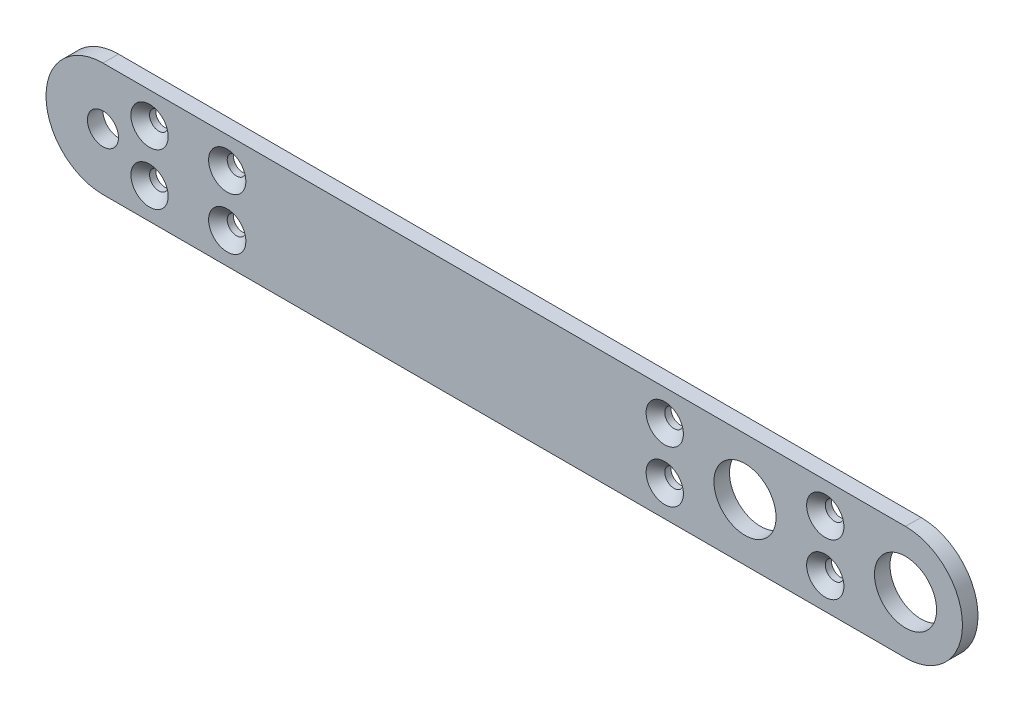
ISO-10303-21;
HEADER;
FILE_DESCRIPTION(('STEP AP214'),'2;1');
FILE_NAME('part.step','',(''),(''),'','','');
FILE_SCHEMA(('AUTOMOTIVE_DESIGN { 1 0 10303 214 1 1 1 1 }'));
ENDSEC;
DATA;
#1=APPLICATION_CONTEXT('core data for automotive mechanical design processes');
#2=APPLICATION_PROTOCOL_DEFINITION('international standard','automotive_design',2000,#1);
#3=PRODUCT_CONTEXT('',#1,'mechanical');
#4=PRODUCT('Part','Part','',(#3));
#5=PRODUCT_RELATED_PRODUCT_CATEGORY('part','',(#4));
#6=PRODUCT_DEFINITION_FORMATION('','',#4);
#7=PRODUCT_DEFINITION_CONTEXT('part definition',#1,'design');
#8=PRODUCT_DEFINITION('design','',#6,#7);
#9=PRODUCT_DEFINITION_SHAPE('','',#8);
#10=(LENGTH_UNIT() NAMED_UNIT(*) SI_UNIT(.MILLI.,.METRE.));
#11=(NAMED_UNIT(*) PLANE_ANGLE_UNIT() SI_UNIT($,.RADIAN.));
#12=(NAMED_UNIT(*) SI_UNIT($,.STERADIAN.) SOLID_ANGLE_UNIT());
#13=UNCERTAINTY_MEASURE_WITH_UNIT(LENGTH_MEASURE(1.E-05),#10,'distance_accuracy_value','');
#14=(GEOMETRIC_REPRESENTATION_CONTEXT(3) GLOBAL_UNCERTAINTY_ASSIGNED_CONTEXT((#13)) GLOBAL_UNIT_ASSIGNED_CONTEXT((#10,
#11,#12)) REPRESENTATION_CONTEXT('',''));
#15=CARTESIAN_POINT('',(0.,0.,0.));
#16=DIRECTION('',(0.,0.,1.));
#17=DIRECTION('',(1.,0.,0.));
#18=AXIS2_PLACEMENT_3D('',#15,#16,#17);
#19=CARTESIAN_POINT('',(15.5,0.,1.5));
#20=DIRECTION('',(0.,0.,1.));
#21=DIRECTION('',(1.,0.,0.));
#22=AXIS2_PLACEMENT_3D('',#19,#20,#21);
#23=PLANE('',#22);
#24=CARTESIAN_POINT('',(7.75,-2.49999999999999,1.5));
#25=DIRECTION('',(0.,0.,1.));
#26=DIRECTION('',(1.,0.,0.));
#27=AXIS2_PLACEMENT_3D('',#24,#25,#26);
#28=CIRCLE('',#27,1.8);
#29=CARTESIAN_POINT('',(9.55,-2.49999999999999,1.5));
#30=VERTEX_POINT('',#29);
#31=EDGE_CURVE('E197',#30,#30,#28,.T.);
#32=ORIENTED_EDGE('',*,*,#31,.F.);
#33=EDGE_LOOP('',(#32));
#34=FACE_BOUND('',#33,.T.);
#35=CARTESIAN_POINT('',(-7.75,-2.49999999999999,1.5));
#36=DIRECTION('',(0.,0.,1.));
#37=DIRECTION('',(1.,0.,0.));
#38=AXIS2_PLACEMENT_3D('',#35,#36,#37);
#39=CIRCLE('',#38,1.8);
#40=CARTESIAN_POINT('',(-5.95,-2.49999999999999,1.5));
#41=VERTEX_POINT('',#40);
#42=EDGE_CURVE('E188',#41,#41,#39,.T.);
#43=ORIENTED_EDGE('',*,*,#42,.F.);
#44=EDGE_LOOP('',(#43));
#45=FACE_BOUND('',#44,.T.);
#46=CARTESIAN_POINT('',(-57.5,-2.49999999999999,1.5));
#47=DIRECTION('',(0.,0.,1.));
#48=DIRECTION('',(1.,0.,0.));
#49=AXIS2_PLACEMENT_3D('',#46,#47,#48);
#50=CIRCLE('',#49,1.8);
#51=CARTESIAN_POINT('',(-55.7,-2.49999999999999,1.5));
#52=VERTEX_POINT('',#51);
#53=EDGE_CURVE('E179',#52,#52,#50,.T.);
#54=ORIENTED_EDGE('',*,*,#53,.F.);
#55=EDGE_LOOP('',(#54));
#56=FACE_BOUND('',#55,.T.);
#57=CARTESIAN_POINT('',(-50.,-2.49999999999999,1.5));
#58=DIRECTION('',(0.,0.,1.));
#59=DIRECTION('',(1.,0.,0.));
#60=AXIS2_PLACEMENT_3D('',#57,#58,#59);
#61=CIRCLE('',#60,1.8);
#62=CARTESIAN_POINT('',(-48.2,-2.49999999999999,1.5));
#63=VERTEX_POINT('',#62);
#64=EDGE_CURVE('E170',#63,#63,#61,.T.);
#65=ORIENTED_EDGE('',*,*,#64,.F.);
#66=EDGE_LOOP('',(#65));
#67=FACE_BOUND('',#66,.T.);
#68=CARTESIAN_POINT('',(7.75,2.49999999999999,1.5));
#69=DIRECTION('',(0.,0.,1.));
#70=DIRECTION('',(1.,0.,0.));
#71=AXIS2_PLACEMENT_3D('',#68,#69,#70);
#72=CIRCLE('',#71,1.8);
#73=CARTESIAN_POINT('',(9.55,2.49999999999999,1.5));
#74=VERTEX_POINT('',#73);
#75=EDGE_CURVE('E161',#74,#74,#72,.T.);
#76=ORIENTED_EDGE('',*,*,#75,.F.);
#77=EDGE_LOOP('',(#76));
#78=FACE_BOUND('',#77,.T.);
#79=CARTESIAN_POINT('',(-7.75,2.49999999999999,1.5));
#80=DIRECTION('',(0.,0.,1.));
#81=DIRECTION('',(1.,0.,0.));
#82=AXIS2_PLACEMENT_3D('',#79,#80,#81);
#83=CIRCLE('',#82,1.8);
#84=CARTESIAN_POINT('',(-5.95,2.49999999999999,1.5));
#85=VERTEX_POINT('',#84);
#86=EDGE_CURVE('E152',#85,#85,#83,.T.);
#87=ORIENTED_EDGE('',*,*,#86,.F.);
#88=EDGE_LOOP('',(#87));
#89=FACE_BOUND('',#88,.T.);
#90=CARTESIAN_POINT('',(-57.5,2.49999999999999,1.5));
#91=DIRECTION('',(0.,0.,1.));
#92=DIRECTION('',(1.,0.,0.));
#93=AXIS2_PLACEMENT_3D('',#90,#91,#92);
#94=CIRCLE('',#93,1.8);
#95=CARTESIAN_POINT('',(-55.7,2.49999999999999,1.5));
#96=VERTEX_POINT('',#95);
#97=EDGE_CURVE('E143',#96,#96,#94,.T.);
#98=ORIENTED_EDGE('',*,*,#97,.F.);
#99=EDGE_LOOP('',(#98));
#100=FACE_BOUND('',#99,.T.);
#101=CARTESIAN_POINT('',(-50.,2.49999999999999,1.5));
#102=DIRECTION('',(0.,0.,1.));
#103=DIRECTION('',(1.,0.,0.));
#104=AXIS2_PLACEMENT_3D('',#101,#102,#103);
#105=CIRCLE('',#104,1.8);
#106=CARTESIAN_POINT('',(-48.2,2.49999999999999,1.5));
#107=VERTEX_POINT('',#106);
#108=EDGE_CURVE('E134',#107,#107,#105,.T.);
#109=ORIENTED_EDGE('',*,*,#108,.F.);
#110=EDGE_LOOP('',(#109));
#111=FACE_BOUND('',#110,.T.);
#112=CARTESIAN_POINT('',(0.,0.,1.5));
#113=DIRECTION('',(0.,0.,1.));
#114=DIRECTION('',(1.,0.,0.));
#115=AXIS2_PLACEMENT_3D('',#112,#113,#114);
#116=CIRCLE('',#115,3.);
#117=CARTESIAN_POINT('',(3.,0.,1.5));
#118=VERTEX_POINT('',#117);
#119=EDGE_CURVE('E114',#118,#118,#116,.T.);
#120=ORIENTED_EDGE('',*,*,#119,.F.);
#121=EDGE_LOOP('',(#120));
#122=FACE_BOUND('',#121,.T.);
#123=CARTESIAN_POINT('',(15.5,0.,1.5));
#124=DIRECTION('',(0.,0.,1.));
#125=DIRECTION('',(1.,0.,0.));
#126=AXIS2_PLACEMENT_3D('',#123,#124,#125);
#127=CIRCLE('',#126,5.5);
#128=CARTESIAN_POINT('',(15.5,-5.5,1.5));
#129=VERTEX_POINT('',#128);
#130=CARTESIAN_POINT('',(15.5,5.5,1.5));
#131=VERTEX_POINT('',#130);
#132=EDGE_CURVE('E84',#129,#131,#127,.T.);
#133=ORIENTED_EDGE('',*,*,#132,.T.);
#134=DIRECTION('',(-1.,0.,0.));
#135=VECTOR('',#134,1.);
#136=CARTESIAN_POINT('',(15.5,5.5,1.5));
#137=LINE('',#136,#135);
#138=CARTESIAN_POINT('',(-62.,5.49999999999999,1.5));
#139=VERTEX_POINT('',#138);
#140=EDGE_CURVE('E79',#131,#139,#137,.T.);
#141=ORIENTED_EDGE('',*,*,#140,.T.);
#142=CARTESIAN_POINT('',(-62.,-4.25440932483312E-13,1.5));
#143=DIRECTION('',(0.,0.,1.));
#144=DIRECTION('',(1.,0.,0.));
#145=AXIS2_PLACEMENT_3D('',#142,#143,#144);
#146=CIRCLE('',#145,5.49999999999999);
#147=CARTESIAN_POINT('',(-62.,-5.50000000000041,1.5));
#148=VERTEX_POINT('',#147);
#149=EDGE_CURVE('E82',#139,#148,#146,.T.);
#150=ORIENTED_EDGE('',*,*,#149,.T.);
#151=DIRECTION('',(1.,0.,0.));
#152=VECTOR('',#151,1.);
#153=CARTESIAN_POINT('',(-62.,-5.49999999999999,1.5));
#154=LINE('',#153,#152);
#155=EDGE_CURVE('E49',#148,#129,#154,.T.);
#156=ORIENTED_EDGE('',*,*,#155,.T.);
#157=EDGE_LOOP('',(#133,#141,#150,#156));
#158=FACE_BOUND('',#157,.T.);
#159=CARTESIAN_POINT('',(-62.,-4.25440932483312E-13,1.5));
#160=DIRECTION('',(0.,0.,1.));
#161=DIRECTION('',(1.,0.,0.));
#162=AXIS2_PLACEMENT_3D('',#159,#160,#161);
#163=CIRCLE('',#162,1.5);
#164=CARTESIAN_POINT('',(-60.5,-4.25440932483312E-13,1.5));
#165=VERTEX_POINT('',#164);
#166=EDGE_CURVE('E99',#165,#165,#163,.T.);
#167=ORIENTED_EDGE('',*,*,#166,.F.);
#168=EDGE_LOOP('',(#167));
#169=FACE_BOUND('',#168,.T.);
#170=CARTESIAN_POINT('',(15.5,0.,1.5));
#171=DIRECTION('',(0.,0.,1.));
#172=DIRECTION('',(1.,0.,0.));
#173=AXIS2_PLACEMENT_3D('',#170,#171,#172);
#174=CIRCLE('',#173,3.);
#175=CARTESIAN_POINT('',(18.5,0.,1.5));
#176=VERTEX_POINT('',#175);
#177=EDGE_CURVE('E120',#176,#176,#174,.T.);
#178=ORIENTED_EDGE('',*,*,#177,.F.);
#179=EDGE_LOOP('',(#178));
#180=FACE_BOUND('',#179,.T.);
#181=ADVANCED_FACE('F32',(#34,#45,#56,#67,#78,#89,#100,#111,#122,#158,#169,#180),#23,.T.);
#182=CARTESIAN_POINT('',(15.5,0.,0.));
#183=DIRECTION('',(0.,0.,1.));
#184=DIRECTION('',(1.,0.,0.));
#185=AXIS2_PLACEMENT_3D('',#182,#183,#184);
#186=PLANE('',#185);
#187=CARTESIAN_POINT('',(7.75,-2.49999999999999,0.));
#188=DIRECTION('',(0.,0.,1.));
#189=DIRECTION('',(1.,0.,0.));
#190=AXIS2_PLACEMENT_3D('',#187,#188,#189);
#191=CIRCLE('',#190,0.9);
#192=CARTESIAN_POINT('',(8.65,-2.49999999999999,0.));
#193=VERTEX_POINT('',#192);
#194=EDGE_CURVE('E191',#193,#193,#191,.T.);
#195=ORIENTED_EDGE('',*,*,#194,.T.);
#196=EDGE_LOOP('',(#195));
#197=FACE_BOUND('',#196,.T.);
#198=CARTESIAN_POINT('',(-7.75,-2.49999999999999,0.));
#199=DIRECTION('',(0.,0.,1.));
#200=DIRECTION('',(1.,0.,0.));
#201=AXIS2_PLACEMENT_3D('',#198,#199,#200);
#202=CIRCLE('',#201,0.9);
#203=CARTESIAN_POINT('',(-6.85,-2.49999999999999,0.));
#204=VERTEX_POINT('',#203);
#205=EDGE_CURVE('E182',#204,#204,#202,.T.);
#206=ORIENTED_EDGE('',*,*,#205,.T.);
#207=EDGE_LOOP('',(#206));
#208=FACE_BOUND('',#207,.T.);
#209=CARTESIAN_POINT('',(-57.5,-2.49999999999999,0.));
#210=DIRECTION('',(0.,0.,1.));
#211=DIRECTION('',(1.,0.,0.));
#212=AXIS2_PLACEMENT_3D('',#209,#210,#211);
#213=CIRCLE('',#212,0.899999999999998);
#214=CARTESIAN_POINT('',(-56.6,-2.49999999999999,0.));
#215=VERTEX_POINT('',#214);
#216=EDGE_CURVE('E173',#215,#215,#213,.T.);
#217=ORIENTED_EDGE('',*,*,#216,.T.);
#218=EDGE_LOOP('',(#217));
#219=FACE_BOUND('',#218,.T.);
#220=CARTESIAN_POINT('',(-50.,-2.49999999999999,0.));
#221=DIRECTION('',(0.,0.,1.));
#222=DIRECTION('',(1.,0.,0.));
#223=AXIS2_PLACEMENT_3D('',#220,#221,#222);
#224=CIRCLE('',#223,0.899999999999998);
#225=CARTESIAN_POINT('',(-49.1,-2.49999999999999,0.));
#226=VERTEX_POINT('',#225);
#227=EDGE_CURVE('E164',#226,#226,#224,.T.);
#228=ORIENTED_EDGE('',*,*,#227,.T.);
#229=EDGE_LOOP('',(#228));
#230=FACE_BOUND('',#229,.T.);
#231=CARTESIAN_POINT('',(7.75,2.49999999999999,0.));
#232=DIRECTION('',(0.,0.,1.));
#233=DIRECTION('',(1.,0.,0.));
#234=AXIS2_PLACEMENT_3D('',#231,#232,#233);
#235=CIRCLE('',#234,0.9);
#236=CARTESIAN_POINT('',(8.65,2.49999999999999,0.));
#237=VERTEX_POINT('',#236);
#238=EDGE_CURVE('E155',#237,#237,#235,.T.);
#239=ORIENTED_EDGE('',*,*,#238,.T.);
#240=EDGE_LOOP('',(#239));
#241=FACE_BOUND('',#240,.T.);
#242=CARTESIAN_POINT('',(-7.75,2.49999999999999,0.));
#243=DIRECTION('',(0.,0.,1.));
#244=DIRECTION('',(1.,0.,0.));
#245=AXIS2_PLACEMENT_3D('',#242,#243,#244);
#246=CIRCLE('',#245,0.9);
#247=CARTESIAN_POINT('',(-6.85,2.49999999999999,0.));
#248=VERTEX_POINT('',#247);
#249=EDGE_CURVE('E146',#248,#248,#246,.T.);
#250=ORIENTED_EDGE('',*,*,#249,.T.);
#251=EDGE_LOOP('',(#250));
#252=FACE_BOUND('',#251,.T.);
#253=CARTESIAN_POINT('',(-57.5,2.49999999999999,0.));
#254=DIRECTION('',(0.,0.,1.));
#255=DIRECTION('',(1.,0.,0.));
#256=AXIS2_PLACEMENT_3D('',#253,#254,#255);
#257=CIRCLE('',#256,0.899999999999998);
#258=CARTESIAN_POINT('',(-56.6,2.49999999999999,0.));
#259=VERTEX_POINT('',#258);
#260=EDGE_CURVE('E137',#259,#259,#257,.T.);
#261=ORIENTED_EDGE('',*,*,#260,.T.);
#262=EDGE_LOOP('',(#261));
#263=FACE_BOUND('',#262,.T.);
#264=CARTESIAN_POINT('',(-50.,2.49999999999999,0.));
#265=DIRECTION('',(0.,0.,1.));
#266=DIRECTION('',(1.,0.,0.));
#267=AXIS2_PLACEMENT_3D('',#264,#265,#266);
#268=CIRCLE('',#267,0.899999999999998);
#269=CARTESIAN_POINT('',(-49.1,2.49999999999999,0.));
#270=VERTEX_POINT('',#269);
#271=EDGE_CURVE('E126',#270,#270,#268,.T.);
#272=ORIENTED_EDGE('',*,*,#271,.T.);
#273=EDGE_LOOP('',(#272));
#274=FACE_BOUND('',#273,.T.);
#275=CARTESIAN_POINT('',(0.,0.,0.));
#276=DIRECTION('',(0.,0.,1.));
#277=DIRECTION('',(1.,0.,0.));
#278=AXIS2_PLACEMENT_3D('',#275,#276,#277);
#279=CIRCLE('',#278,3.);
#280=CARTESIAN_POINT('',(3.,0.,0.));
#281=VERTEX_POINT('',#280);
#282=EDGE_CURVE('E117',#281,#281,#279,.T.);
#283=ORIENTED_EDGE('',*,*,#282,.T.);
#284=EDGE_LOOP('',(#283));
#285=FACE_BOUND('',#284,.T.);
#286=CARTESIAN_POINT('',(15.5,0.,0.));
#287=DIRECTION('',(0.,0.,1.));
#288=DIRECTION('',(1.,0.,0.));
#289=AXIS2_PLACEMENT_3D('',#286,#287,#288);
#290=CIRCLE('',#289,5.5);
#291=CARTESIAN_POINT('',(15.5,-5.5,0.));
#292=VERTEX_POINT('',#291);
#293=CARTESIAN_POINT('',(15.5,5.5,0.));
#294=VERTEX_POINT('',#293);
#295=EDGE_CURVE('E96',#292,#294,#290,.T.);
#296=ORIENTED_EDGE('',*,*,#295,.F.);
#297=DIRECTION('',(1.,0.,0.));
#298=VECTOR('',#297,1.);
#299=CARTESIAN_POINT('',(-62.,-5.49999999999999,0.));
#300=LINE('',#299,#298);
#301=CARTESIAN_POINT('',(-62.,-5.50000000000041,0.));
#302=VERTEX_POINT('',#301);
#303=EDGE_CURVE('E72',#302,#292,#300,.T.);
#304=ORIENTED_EDGE('',*,*,#303,.F.);
#305=CARTESIAN_POINT('',(-62.,-4.25440932483312E-13,0.));
#306=DIRECTION('',(0.,0.,1.));
#307=DIRECTION('',(1.,0.,0.));
#308=AXIS2_PLACEMENT_3D('',#305,#306,#307);
#309=CIRCLE('',#308,5.49999999999999);
#310=CARTESIAN_POINT('',(-62.,5.49999999999999,0.));
#311=VERTEX_POINT('',#310);
#312=EDGE_CURVE('E66',#311,#302,#309,.T.);
#313=ORIENTED_EDGE('',*,*,#312,.F.);
#314=DIRECTION('',(-1.,0.,0.));
#315=VECTOR('',#314,1.);
#316=CARTESIAN_POINT('',(15.5,5.5,0.));
#317=LINE('',#316,#315);
#318=EDGE_CURVE('E88',#294,#311,#317,.T.);
#319=ORIENTED_EDGE('',*,*,#318,.F.);
#320=EDGE_LOOP('',(#296,#304,#313,#319));
#321=FACE_BOUND('',#320,.T.);
#322=CARTESIAN_POINT('',(-62.,-4.25440932483312E-13,0.));
#323=DIRECTION('',(0.,0.,1.));
#324=DIRECTION('',(1.,0.,0.));
#325=AXIS2_PLACEMENT_3D('',#322,#323,#324);
#326=CIRCLE('',#325,1.5);
#327=CARTESIAN_POINT('',(-60.5,-4.25440932483312E-13,0.));
#328=VERTEX_POINT('',#327);
#329=EDGE_CURVE('E111',#328,#328,#326,.T.);
#330=ORIENTED_EDGE('',*,*,#329,.T.);
#331=EDGE_LOOP('',(#330));
#332=FACE_BOUND('',#331,.T.);
#333=CARTESIAN_POINT('',(15.5,0.,0.));
#334=DIRECTION('',(0.,0.,1.));
#335=DIRECTION('',(1.,0.,0.));
#336=AXIS2_PLACEMENT_3D('',#333,#334,#335);
#337=CIRCLE('',#336,3.);
#338=CARTESIAN_POINT('',(18.5,0.,0.));
#339=VERTEX_POINT('',#338);
#340=EDGE_CURVE('E123',#339,#339,#337,.T.);
#341=ORIENTED_EDGE('',*,*,#340,.T.);
#342=EDGE_LOOP('',(#341));
#343=FACE_BOUND('',#342,.T.);
#344=ADVANCED_FACE('F107',(#197,#208,#219,#230,#241,#252,#263,#274,#285,#321,#332,#343),#186,.F.);
#345=CARTESIAN_POINT('',(15.5,0.,1.5));
#346=DIRECTION('',(0.,0.,-1.));
#347=DIRECTION('',(-1.,0.,0.));
#348=AXIS2_PLACEMENT_3D('',#345,#346,#347);
#349=CYLINDRICAL_SURFACE('',#348,5.5);
#350=ORIENTED_EDGE('',*,*,#295,.T.);
#351=DIRECTION('',(0.,0.,-1.));
#352=VECTOR('',#351,1.);
#353=CARTESIAN_POINT('',(15.5,5.5,1.5));
#354=LINE('',#353,#352);
#355=EDGE_CURVE('E11',#131,#294,#354,.T.);
#356=ORIENTED_EDGE('',*,*,#355,.F.);
#357=ORIENTED_EDGE('',*,*,#132,.F.);
#358=DIRECTION('',(0.,0.,-1.));
#359=VECTOR('',#358,1.);
#360=CARTESIAN_POINT('',(15.5,-5.5,1.5));
#361=LINE('',#360,#359);
#362=EDGE_CURVE('E92',#129,#292,#361,.T.);
#363=ORIENTED_EDGE('',*,*,#362,.T.);
#364=EDGE_LOOP('',(#350,#356,#357,#363));
#365=FACE_BOUND('',#364,.T.);
#366=ADVANCED_FACE('F34',(#365),#349,.T.);
#367=CARTESIAN_POINT('',(15.5,5.5,1.5));
#368=DIRECTION('',(0.,-1.,0.));
#369=DIRECTION('',(1.,0.,0.));
#370=AXIS2_PLACEMENT_3D('',#367,#368,#369);
#371=PLANE('',#370);
#372=ORIENTED_EDGE('',*,*,#318,.T.);
#373=DIRECTION('',(0.,0.,-1.));
#374=VECTOR('',#373,1.);
#375=CARTESIAN_POINT('',(-62.,5.49999999999999,1.5));
#376=LINE('',#375,#374);
#377=EDGE_CURVE('E41',#139,#311,#376,.T.);
#378=ORIENTED_EDGE('',*,*,#377,.F.);
#379=ORIENTED_EDGE('',*,*,#140,.F.);
#380=ORIENTED_EDGE('',*,*,#355,.T.);
#381=EDGE_LOOP('',(#372,#378,#379,#380));
#382=FACE_BOUND('',#381,.T.);
#383=ADVANCED_FACE('F87',(#382),#371,.F.);
#384=CARTESIAN_POINT('',(-62.,-4.25440932483312E-13,1.5));
#385=DIRECTION('',(0.,0.,-1.));
#386=DIRECTION('',(-1.,0.,0.));
#387=AXIS2_PLACEMENT_3D('',#384,#385,#386);
#388=CYLINDRICAL_SURFACE('',#387,5.49999999999999);
#389=ORIENTED_EDGE('',*,*,#312,.T.);
#390=DIRECTION('',(0.,0.,-1.));
#391=VECTOR('',#390,1.);
#392=CARTESIAN_POINT('',(-62.,-5.50000000000041,1.5));
#393=LINE('',#392,#391);
#394=EDGE_CURVE('E89',#148,#302,#393,.T.);
#395=ORIENTED_EDGE('',*,*,#394,.F.);
#396=ORIENTED_EDGE('',*,*,#149,.F.);
#397=ORIENTED_EDGE('',*,*,#377,.T.);
#398=EDGE_LOOP('',(#389,#395,#396,#397));
#399=FACE_BOUND('',#398,.T.);
#400=ADVANCED_FACE('F90',(#399),#388,.T.);
#401=CARTESIAN_POINT('',(-62.,-5.49999999999999,1.5));
#402=DIRECTION('',(0.,1.,0.));
#403=DIRECTION('',(-1.,0.,0.));
#404=AXIS2_PLACEMENT_3D('',#401,#402,#403);
#405=PLANE('',#404);
#406=ORIENTED_EDGE('',*,*,#303,.T.);
#407=ORIENTED_EDGE('',*,*,#362,.F.);
#408=ORIENTED_EDGE('',*,*,#155,.F.);
#409=ORIENTED_EDGE('',*,*,#394,.T.);
#410=EDGE_LOOP('',(#406,#407,#408,#409));
#411=FACE_BOUND('',#410,.T.);
#412=ADVANCED_FACE('F104',(#411),#405,.F.);
#413=CARTESIAN_POINT('',(-62.,-4.25440932483312E-13,1.5));
#414=DIRECTION('',(0.,0.,-1.));
#415=DIRECTION('',(-1.,0.,0.));
#416=AXIS2_PLACEMENT_3D('',#413,#414,#415);
#417=CYLINDRICAL_SURFACE('',#416,1.5);
#418=ORIENTED_EDGE('',*,*,#166,.T.);
#419=EDGE_LOOP('',(#418));
#420=FACE_BOUND('',#419,.T.);
#421=ORIENTED_EDGE('',*,*,#329,.F.);
#422=EDGE_LOOP('',(#421));
#423=FACE_BOUND('',#422,.T.);
#424=ADVANCED_FACE('F226',(#420,#423),#417,.F.);
#425=CARTESIAN_POINT('',(0.,0.,1.5));
#426=DIRECTION('',(0.,0.,-1.));
#427=DIRECTION('',(-1.,0.,0.));
#428=AXIS2_PLACEMENT_3D('',#425,#426,#427);
#429=CYLINDRICAL_SURFACE('',#428,3.);
#430=ORIENTED_EDGE('',*,*,#119,.T.);
#431=EDGE_LOOP('',(#430));
#432=FACE_BOUND('',#431,.T.);
#433=ORIENTED_EDGE('',*,*,#282,.F.);
#434=EDGE_LOOP('',(#433));
#435=FACE_BOUND('',#434,.T.);
#436=ADVANCED_FACE('F222',(#432,#435),#429,.F.);
#437=CARTESIAN_POINT('',(15.5,0.,1.5));
#438=DIRECTION('',(0.,0.,-1.));
#439=DIRECTION('',(-1.,0.,0.));
#440=AXIS2_PLACEMENT_3D('',#437,#438,#439);
#441=CYLINDRICAL_SURFACE('',#440,3.);
#442=ORIENTED_EDGE('',*,*,#177,.T.);
#443=EDGE_LOOP('',(#442));
#444=FACE_BOUND('',#443,.T.);
#445=ORIENTED_EDGE('',*,*,#340,.F.);
#446=EDGE_LOOP('',(#445));
#447=FACE_BOUND('',#446,.T.);
#448=ADVANCED_FACE('F225',(#444,#447),#441,.F.);
#449=CARTESIAN_POINT('',(-50.,2.49999999999999,1.5));
#450=DIRECTION('',(0.,0.,1.));
#451=DIRECTION('',(1.,0.,0.));
#452=AXIS2_PLACEMENT_3D('',#449,#450,#451);
#453=CYLINDRICAL_SURFACE('',#452,0.899999999999998);
#454=ORIENTED_EDGE('',*,*,#271,.F.);
#455=EDGE_LOOP('',(#454));
#456=FACE_BOUND('',#455,.T.);
#457=CARTESIAN_POINT('',(-50.,2.49999999999999,0.6));
#458=DIRECTION('',(0.,0.,1.));
#459=DIRECTION('',(1.,0.,0.));
#460=AXIS2_PLACEMENT_3D('',#457,#458,#459);
#461=CIRCLE('',#460,0.899999999999998);
#462=CARTESIAN_POINT('',(-49.1,2.49999999999999,0.6));
#463=VERTEX_POINT('',#462);
#464=EDGE_CURVE('E131',#463,#463,#461,.T.);
#465=ORIENTED_EDGE('',*,*,#464,.T.);
#466=EDGE_LOOP('',(#465));
#467=FACE_BOUND('',#466,.T.);
#468=ADVANCED_FACE('F271',(#456,#467),#453,.F.);
#469=CARTESIAN_POINT('',(-50.,2.49999999999999,1.5));
#470=DIRECTION('',(0.,0.,1.));
#471=DIRECTION('',(1.,0.,0.));
#472=AXIS2_PLACEMENT_3D('',#469,#470,#471);
#473=CONICAL_SURFACE('',#472,1.8,0.785398163397451);
#474=ORIENTED_EDGE('',*,*,#464,.F.);
#475=EDGE_LOOP('',(#474));
#476=FACE_BOUND('',#475,.T.);
#477=ORIENTED_EDGE('',*,*,#108,.T.);
#478=EDGE_LOOP('',(#477));
#479=FACE_BOUND('',#478,.T.);
#480=ADVANCED_FACE('F279',(#476,#479),#473,.F.);
#481=CARTESIAN_POINT('',(-57.5,2.49999999999999,1.5));
#482=DIRECTION('',(0.,0.,1.));
#483=DIRECTION('',(1.,0.,0.));
#484=AXIS2_PLACEMENT_3D('',#481,#482,#483);
#485=CYLINDRICAL_SURFACE('',#484,0.899999999999998);
#486=ORIENTED_EDGE('',*,*,#260,.F.);
#487=EDGE_LOOP('',(#486));
#488=FACE_BOUND('',#487,.T.);
#489=CARTESIAN_POINT('',(-57.5,2.49999999999999,0.6));
#490=DIRECTION('',(0.,0.,1.));
#491=DIRECTION('',(1.,0.,0.));
#492=AXIS2_PLACEMENT_3D('',#489,#490,#491);
#493=CIRCLE('',#492,0.899999999999998);
#494=CARTESIAN_POINT('',(-56.6,2.49999999999999,0.6));
#495=VERTEX_POINT('',#494);
#496=EDGE_CURVE('E140',#495,#495,#493,.T.);
#497=ORIENTED_EDGE('',*,*,#496,.T.);
#498=EDGE_LOOP('',(#497));
#499=FACE_BOUND('',#498,.T.);
#500=ADVANCED_FACE('F287',(#488,#499),#485,.F.);
#501=CARTESIAN_POINT('',(-57.5,2.49999999999999,1.5));
#502=DIRECTION('',(0.,0.,1.));
#503=DIRECTION('',(1.,0.,0.));
#504=AXIS2_PLACEMENT_3D('',#501,#502,#503);
#505=CONICAL_SURFACE('',#504,1.8,0.785398163397451);
#506=ORIENTED_EDGE('',*,*,#496,.F.);
#507=EDGE_LOOP('',(#506));
#508=FACE_BOUND('',#507,.T.);
#509=ORIENTED_EDGE('',*,*,#97,.T.);
#510=EDGE_LOOP('',(#509));
#511=FACE_BOUND('',#510,.T.);
#512=ADVANCED_FACE('F295',(#508,#511),#505,.F.);
#513=CARTESIAN_POINT('',(-7.75,2.49999999999999,1.5));
#514=DIRECTION('',(0.,0.,1.));
#515=DIRECTION('',(1.,0.,0.));
#516=AXIS2_PLACEMENT_3D('',#513,#514,#515);
#517=CYLINDRICAL_SURFACE('',#516,0.9);
#518=ORIENTED_EDGE('',*,*,#249,.F.);
#519=EDGE_LOOP('',(#518));
#520=FACE_BOUND('',#519,.T.);
#521=CARTESIAN_POINT('',(-7.75,2.49999999999999,0.6));
#522=DIRECTION('',(0.,0.,1.));
#523=DIRECTION('',(1.,0.,0.));
#524=AXIS2_PLACEMENT_3D('',#521,#522,#523);
#525=CIRCLE('',#524,0.9);
#526=CARTESIAN_POINT('',(-6.85,2.49999999999999,0.6));
#527=VERTEX_POINT('',#526);
#528=EDGE_CURVE('E149',#527,#527,#525,.T.);
#529=ORIENTED_EDGE('',*,*,#528,.T.);
#530=EDGE_LOOP('',(#529));
#531=FACE_BOUND('',#530,.T.);
#532=ADVANCED_FACE('F303',(#520,#531),#517,.F.);
#533=CARTESIAN_POINT('',(-7.75,2.49999999999999,1.5));
#534=DIRECTION('',(0.,0.,1.));
#535=DIRECTION('',(1.,0.,0.));
#536=AXIS2_PLACEMENT_3D('',#533,#534,#535);
#537=CONICAL_SURFACE('',#536,1.8,0.785398163397449);
#538=ORIENTED_EDGE('',*,*,#528,.F.);
#539=EDGE_LOOP('',(#538));
#540=FACE_BOUND('',#539,.T.);
#541=ORIENTED_EDGE('',*,*,#86,.T.);
#542=EDGE_LOOP('',(#541));
#543=FACE_BOUND('',#542,.T.);
#544=ADVANCED_FACE('F311',(#540,#543),#537,.F.);
#545=CARTESIAN_POINT('',(7.75,2.49999999999999,1.5));
#546=DIRECTION('',(0.,0.,1.));
#547=DIRECTION('',(1.,0.,0.));
#548=AXIS2_PLACEMENT_3D('',#545,#546,#547);
#549=CYLINDRICAL_SURFACE('',#548,0.9);
#550=ORIENTED_EDGE('',*,*,#238,.F.);
#551=EDGE_LOOP('',(#550));
#552=FACE_BOUND('',#551,.T.);
#553=CARTESIAN_POINT('',(7.75,2.49999999999999,0.6));
#554=DIRECTION('',(0.,0.,1.));
#555=DIRECTION('',(1.,0.,0.));
#556=AXIS2_PLACEMENT_3D('',#553,#554,#555);
#557=CIRCLE('',#556,0.9);
#558=CARTESIAN_POINT('',(8.65,2.49999999999999,0.6));
#559=VERTEX_POINT('',#558);
#560=EDGE_CURVE('E158',#559,#559,#557,.T.);
#561=ORIENTED_EDGE('',*,*,#560,.T.);
#562=EDGE_LOOP('',(#561));
#563=FACE_BOUND('',#562,.T.);
#564=ADVANCED_FACE('F319',(#552,#563),#549,.F.);
#565=CARTESIAN_POINT('',(7.75,2.49999999999999,1.5));
#566=DIRECTION('',(0.,0.,1.));
#567=DIRECTION('',(1.,0.,0.));
#568=AXIS2_PLACEMENT_3D('',#565,#566,#567);
#569=CONICAL_SURFACE('',#568,1.8,0.785398163397448);
#570=ORIENTED_EDGE('',*,*,#560,.F.);
#571=EDGE_LOOP('',(#570));
#572=FACE_BOUND('',#571,.T.);
#573=ORIENTED_EDGE('',*,*,#75,.T.);
#574=EDGE_LOOP('',(#573));
#575=FACE_BOUND('',#574,.T.);
#576=ADVANCED_FACE('F327',(#572,#575),#569,.F.);
#577=CARTESIAN_POINT('',(-50.,-2.49999999999999,1.5));
#578=DIRECTION('',(0.,0.,1.));
#579=DIRECTION('',(1.,0.,0.));
#580=AXIS2_PLACEMENT_3D('',#577,#578,#579);
#581=CYLINDRICAL_SURFACE('',#580,0.899999999999998);
#582=ORIENTED_EDGE('',*,*,#227,.F.);
#583=EDGE_LOOP('',(#582));
#584=FACE_BOUND('',#583,.T.);
#585=CARTESIAN_POINT('',(-50.,-2.49999999999999,0.6));
#586=DIRECTION('',(0.,0.,1.));
#587=DIRECTION('',(1.,0.,0.));
#588=AXIS2_PLACEMENT_3D('',#585,#586,#587);
#589=CIRCLE('',#588,0.899999999999998);
#590=CARTESIAN_POINT('',(-49.1,-2.49999999999999,0.6));
#591=VERTEX_POINT('',#590);
#592=EDGE_CURVE('E167',#591,#591,#589,.T.);
#593=ORIENTED_EDGE('',*,*,#592,.T.);
#594=EDGE_LOOP('',(#593));
#595=FACE_BOUND('',#594,.T.);
#596=ADVANCED_FACE('F335',(#584,#595),#581,.F.);
#597=CARTESIAN_POINT('',(-50.,-2.49999999999999,1.5));
#598=DIRECTION('',(0.,0.,1.));
#599=DIRECTION('',(1.,0.,0.));
#600=AXIS2_PLACEMENT_3D('',#597,#598,#599);
#601=CONICAL_SURFACE('',#600,1.8,0.785398163397451);
#602=ORIENTED_EDGE('',*,*,#592,.F.);
#603=EDGE_LOOP('',(#602));
#604=FACE_BOUND('',#603,.T.);
#605=ORIENTED_EDGE('',*,*,#64,.T.);
#606=EDGE_LOOP('',(#605));
#607=FACE_BOUND('',#606,.T.);
#608=ADVANCED_FACE('F344',(#604,#607),#601,.F.);
#609=CARTESIAN_POINT('',(-57.5,-2.49999999999999,1.5));
#610=DIRECTION('',(0.,0.,1.));
#611=DIRECTION('',(1.,0.,0.));
#612=AXIS2_PLACEMENT_3D('',#609,#610,#611);
#613=CYLINDRICAL_SURFACE('',#612,0.899999999999998);
#614=ORIENTED_EDGE('',*,*,#216,.F.);
#615=EDGE_LOOP('',(#614));
#616=FACE_BOUND('',#615,.T.);
#617=CARTESIAN_POINT('',(-57.5,-2.49999999999999,0.6));
#618=DIRECTION('',(0.,0.,1.));
#619=DIRECTION('',(1.,0.,0.));
#620=AXIS2_PLACEMENT_3D('',#617,#618,#619);
#621=CIRCLE('',#620,0.899999999999998);
#622=CARTESIAN_POINT('',(-56.6,-2.49999999999999,0.6));
#623=VERTEX_POINT('',#622);
#624=EDGE_CURVE('E176',#623,#623,#621,.T.);
#625=ORIENTED_EDGE('',*,*,#624,.T.);
#626=EDGE_LOOP('',(#625));
#627=FACE_BOUND('',#626,.T.);
#628=ADVANCED_FACE('F352',(#616,#627),#613,.F.);
#629=CARTESIAN_POINT('',(-57.5,-2.49999999999999,1.5));
#630=DIRECTION('',(0.,0.,1.));
#631=DIRECTION('',(1.,0.,0.));
#632=AXIS2_PLACEMENT_3D('',#629,#630,#631);
#633=CONICAL_SURFACE('',#632,1.8,0.785398163397451);
#634=ORIENTED_EDGE('',*,*,#624,.F.);
#635=EDGE_LOOP('',(#634));
#636=FACE_BOUND('',#635,.T.);
#637=ORIENTED_EDGE('',*,*,#53,.T.);
#638=EDGE_LOOP('',(#637));
#639=FACE_BOUND('',#638,.T.);
#640=ADVANCED_FACE('F360',(#636,#639),#633,.F.);
#641=CARTESIAN_POINT('',(-7.75,-2.49999999999999,1.5));
#642=DIRECTION('',(0.,0.,1.));
#643=DIRECTION('',(1.,0.,0.));
#644=AXIS2_PLACEMENT_3D('',#641,#642,#643);
#645=CYLINDRICAL_SURFACE('',#644,0.9);
#646=ORIENTED_EDGE('',*,*,#205,.F.);
#647=EDGE_LOOP('',(#646));
#648=FACE_BOUND('',#647,.T.);
#649=CARTESIAN_POINT('',(-7.75,-2.49999999999999,0.6));
#650=DIRECTION('',(0.,0.,1.));
#651=DIRECTION('',(1.,0.,0.));
#652=AXIS2_PLACEMENT_3D('',#649,#650,#651);
#653=CIRCLE('',#652,0.9);
#654=CARTESIAN_POINT('',(-6.85,-2.49999999999999,0.6));
#655=VERTEX_POINT('',#654);
#656=EDGE_CURVE('E185',#655,#655,#653,.T.);
#657=ORIENTED_EDGE('',*,*,#656,.T.);
#658=EDGE_LOOP('',(#657));
#659=FACE_BOUND('',#658,.T.);
#660=ADVANCED_FACE('F368',(#648,#659),#645,.F.);
#661=CARTESIAN_POINT('',(-7.75,-2.49999999999999,1.5));
#662=DIRECTION('',(0.,0.,1.));
#663=DIRECTION('',(1.,0.,0.));
#664=AXIS2_PLACEMENT_3D('',#661,#662,#663);
#665=CONICAL_SURFACE('',#664,1.8,0.785398163397449);
#666=ORIENTED_EDGE('',*,*,#656,.F.);
#667=EDGE_LOOP('',(#666));
#668=FACE_BOUND('',#667,.T.);
#669=ORIENTED_EDGE('',*,*,#42,.T.);
#670=EDGE_LOOP('',(#669));
#671=FACE_BOUND('',#670,.T.);
#672=ADVANCED_FACE('F376',(#668,#671),#665,.F.);
#673=CARTESIAN_POINT('',(7.75,-2.49999999999999,1.5));
#674=DIRECTION('',(0.,0.,1.));
#675=DIRECTION('',(1.,0.,0.));
#676=AXIS2_PLACEMENT_3D('',#673,#674,#675);
#677=CYLINDRICAL_SURFACE('',#676,0.9);
#678=ORIENTED_EDGE('',*,*,#194,.F.);
#679=EDGE_LOOP('',(#678));
#680=FACE_BOUND('',#679,.T.);
#681=CARTESIAN_POINT('',(7.75,-2.49999999999999,0.6));
#682=DIRECTION('',(0.,0.,1.));
#683=DIRECTION('',(1.,0.,0.));
#684=AXIS2_PLACEMENT_3D('',#681,#682,#683);
#685=CIRCLE('',#684,0.9);
#686=CARTESIAN_POINT('',(8.65,-2.49999999999999,0.6));
#687=VERTEX_POINT('',#686);
#688=EDGE_CURVE('E194',#687,#687,#685,.T.);
#689=ORIENTED_EDGE('',*,*,#688,.T.);
#690=EDGE_LOOP('',(#689));
#691=FACE_BOUND('',#690,.T.);
#692=ADVANCED_FACE('F384',(#680,#691),#677,.F.);
#693=CARTESIAN_POINT('',(7.75,-2.49999999999999,1.5));
#694=DIRECTION('',(0.,0.,1.));
#695=DIRECTION('',(1.,0.,0.));
#696=AXIS2_PLACEMENT_3D('',#693,#694,#695);
#697=CONICAL_SURFACE('',#696,1.8,0.785398163397448);
#698=ORIENTED_EDGE('',*,*,#688,.F.);
#699=EDGE_LOOP('',(#698));
#700=FACE_BOUND('',#699,.T.);
#701=ORIENTED_EDGE('',*,*,#31,.T.);
#702=EDGE_LOOP('',(#701));
#703=FACE_BOUND('',#702,.T.);
#704=ADVANCED_FACE('F201',(#700,#703),#697,.F.);
#705=CLOSED_SHELL('',(#181,#344,#366,#383,#400,#412,#424,#436,#448,#468,#480,#500,#512,#532,
#544,#564,#576,#596,#608,#628,#640,#660,#672,#692,#704));
#706=MANIFOLD_SOLID_BREP('B2',#705);
#707=ADVANCED_BREP_SHAPE_REPRESENTATION('',(#18,#706),#14);
#708=SHAPE_DEFINITION_REPRESENTATION(#9,#707);
ENDSEC;
END-ISO-10303-21;
